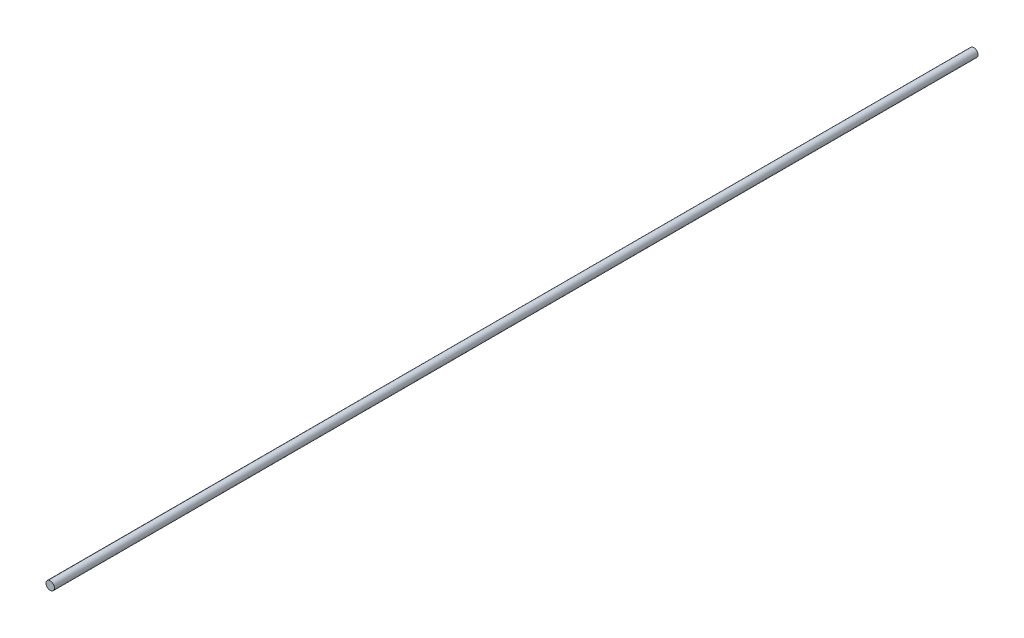
ISO-10303-21;
HEADER;
FILE_DESCRIPTION(('STEP AP214'),'2;1');
FILE_NAME('part.step','',(''),(''),'','','');
FILE_SCHEMA(('AUTOMOTIVE_DESIGN { 1 0 10303 214 1 1 1 1 }'));
ENDSEC;
DATA;
#1=APPLICATION_CONTEXT('core data for automotive mechanical design processes');
#2=APPLICATION_PROTOCOL_DEFINITION('international standard','automotive_design',2000,#1);
#3=PRODUCT_CONTEXT('',#1,'mechanical');
#4=PRODUCT('Part','Part','',(#3));
#5=PRODUCT_RELATED_PRODUCT_CATEGORY('part','',(#4));
#6=PRODUCT_DEFINITION_FORMATION('','',#4);
#7=PRODUCT_DEFINITION_CONTEXT('part definition',#1,'design');
#8=PRODUCT_DEFINITION('design','',#6,#7);
#9=PRODUCT_DEFINITION_SHAPE('','',#8);
#10=(LENGTH_UNIT() NAMED_UNIT(*) SI_UNIT(.MILLI.,.METRE.));
#11=(NAMED_UNIT(*) PLANE_ANGLE_UNIT() SI_UNIT($,.RADIAN.));
#12=(NAMED_UNIT(*) SI_UNIT($,.STERADIAN.) SOLID_ANGLE_UNIT());
#13=UNCERTAINTY_MEASURE_WITH_UNIT(LENGTH_MEASURE(1.E-05),#10,'distance_accuracy_value','');
#14=(GEOMETRIC_REPRESENTATION_CONTEXT(3) GLOBAL_UNCERTAINTY_ASSIGNED_CONTEXT((#13)) GLOBAL_UNIT_ASSIGNED_CONTEXT((#10,
#11,#12)) REPRESENTATION_CONTEXT('',''));
#15=CARTESIAN_POINT('',(0.,0.,0.));
#16=DIRECTION('',(0.,0.,1.));
#17=DIRECTION('',(1.,0.,0.));
#18=AXIS2_PLACEMENT_3D('',#15,#16,#17);
#19=CARTESIAN_POINT('',(0.,0.,330.));
#20=DIRECTION('',(0.,0.,-1.));
#21=DIRECTION('',(-1.,0.,0.));
#22=AXIS2_PLACEMENT_3D('',#19,#20,#21);
#23=CYLINDRICAL_SURFACE('',#22,1.5);
#24=CARTESIAN_POINT('',(0.,0.,330.));
#25=DIRECTION('',(0.,0.,1.));
#26=DIRECTION('',(1.,0.,0.));
#27=AXIS2_PLACEMENT_3D('',#24,#25,#26);
#28=CIRCLE('',#27,1.5);
#29=CARTESIAN_POINT('',(1.5,0.,330.));
#30=VERTEX_POINT('',#29);
#31=EDGE_CURVE('E10',#30,#30,#28,.T.);
#32=ORIENTED_EDGE('',*,*,#31,.F.);
#33=EDGE_LOOP('',(#32));
#34=FACE_BOUND('',#33,.T.);
#35=CARTESIAN_POINT('',(0.,0.,0.));
#36=DIRECTION('',(0.,0.,1.));
#37=DIRECTION('',(1.,0.,0.));
#38=AXIS2_PLACEMENT_3D('',#35,#36,#37);
#39=CIRCLE('',#38,1.5);
#40=CARTESIAN_POINT('',(1.5,0.,0.));
#41=VERTEX_POINT('',#40);
#42=EDGE_CURVE('E42',#41,#41,#39,.T.);
#43=ORIENTED_EDGE('',*,*,#42,.T.);
#44=EDGE_LOOP('',(#43));
#45=FACE_BOUND('',#44,.T.);
#46=ADVANCED_FACE('F39',(#34,#45),#23,.T.);
#47=CARTESIAN_POINT('',(0.,0.,330.));
#48=DIRECTION('',(0.,0.,1.));
#49=DIRECTION('',(1.,0.,0.));
#50=AXIS2_PLACEMENT_3D('',#47,#48,#49);
#51=PLANE('',#50);
#52=ORIENTED_EDGE('',*,*,#31,.T.);
#53=EDGE_LOOP('',(#52));
#54=FACE_BOUND('',#53,.T.);
#55=ADVANCED_FACE('F56',(#54),#51,.T.);
#56=CARTESIAN_POINT('',(0.,0.,0.));
#57=DIRECTION('',(0.,0.,1.));
#58=DIRECTION('',(1.,0.,0.));
#59=AXIS2_PLACEMENT_3D('',#56,#57,#58);
#60=PLANE('',#59);
#61=ORIENTED_EDGE('',*,*,#42,.F.);
#62=EDGE_LOOP('',(#61));
#63=FACE_BOUND('',#62,.T.);
#64=ADVANCED_FACE('F54',(#63),#60,.F.);
#65=CLOSED_SHELL('',(#46,#55,#64));
#66=MANIFOLD_SOLID_BREP('B2',#65);
#67=ADVANCED_BREP_SHAPE_REPRESENTATION('',(#18,#66),#14);
#68=SHAPE_DEFINITION_REPRESENTATION(#9,#67);
ENDSEC;
END-ISO-10303-21;
